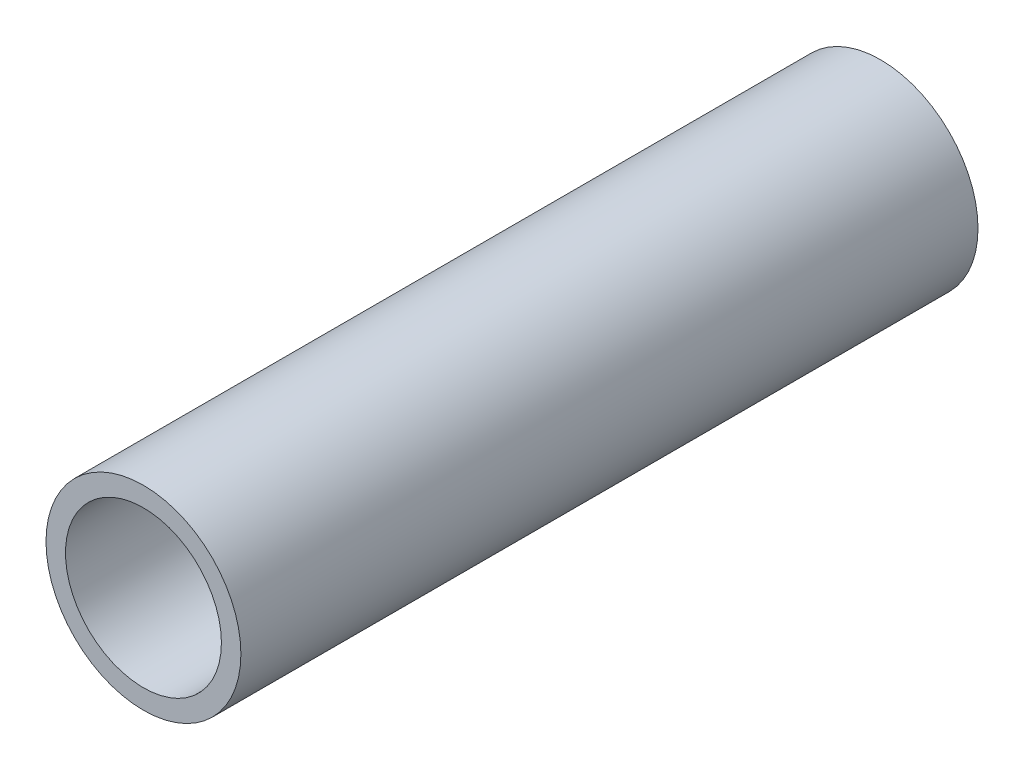
ISO-10303-21;
HEADER;
FILE_DESCRIPTION(('STEP AP214'),'2;1');
FILE_NAME('part.step','',(''),(''),'','','');
FILE_SCHEMA(('AUTOMOTIVE_DESIGN { 1 0 10303 214 1 1 1 1 }'));
ENDSEC;
DATA;
#1=APPLICATION_CONTEXT('core data for automotive mechanical design processes');
#2=APPLICATION_PROTOCOL_DEFINITION('international standard','automotive_design',2000,#1);
#3=PRODUCT_CONTEXT('',#1,'mechanical');
#4=PRODUCT('Part','Part','',(#3));
#5=PRODUCT_RELATED_PRODUCT_CATEGORY('part','',(#4));
#6=PRODUCT_DEFINITION_FORMATION('','',#4);
#7=PRODUCT_DEFINITION_CONTEXT('part definition',#1,'design');
#8=PRODUCT_DEFINITION('design','',#6,#7);
#9=PRODUCT_DEFINITION_SHAPE('','',#8);
#10=(LENGTH_UNIT() NAMED_UNIT(*) SI_UNIT(.MILLI.,.METRE.));
#11=(NAMED_UNIT(*) PLANE_ANGLE_UNIT() SI_UNIT($,.RADIAN.));
#12=(NAMED_UNIT(*) SI_UNIT($,.STERADIAN.) SOLID_ANGLE_UNIT());
#13=UNCERTAINTY_MEASURE_WITH_UNIT(LENGTH_MEASURE(1.E-05),#10,'distance_accuracy_value','');
#14=(GEOMETRIC_REPRESENTATION_CONTEXT(3) GLOBAL_UNCERTAINTY_ASSIGNED_CONTEXT((#13)) GLOBAL_UNIT_ASSIGNED_CONTEXT((#10,
#11,#12)) REPRESENTATION_CONTEXT('',''));
#15=CARTESIAN_POINT('',(0.,0.,0.));
#16=DIRECTION('',(0.,0.,1.));
#17=DIRECTION('',(1.,0.,0.));
#18=AXIS2_PLACEMENT_3D('',#15,#16,#17);
#19=CARTESIAN_POINT('',(0.,0.,9.45499999999958));
#20=DIRECTION('',(0.,0.,1.));
#21=DIRECTION('',(1.,0.,0.));
#22=AXIS2_PLACEMENT_3D('',#19,#20,#21);
#23=PLANE('',#22);
#24=CARTESIAN_POINT('',(0.,0.,9.45499999999958));
#25=DIRECTION('',(0.,0.,1.));
#26=DIRECTION('',(1.,0.,0.));
#27=AXIS2_PLACEMENT_3D('',#24,#25,#26);
#28=CIRCLE('',#27,1.25);
#29=CARTESIAN_POINT('',(1.25,0.,9.45499999999958));
#30=VERTEX_POINT('',#29);
#31=EDGE_CURVE('E10',#30,#30,#28,.T.);
#32=ORIENTED_EDGE('',*,*,#31,.T.);
#33=EDGE_LOOP('',(#32));
#34=FACE_BOUND('',#33,.T.);
#35=CARTESIAN_POINT('',(0.,0.,9.45499999999958));
#36=DIRECTION('',(0.,0.,1.));
#37=DIRECTION('',(1.,0.,0.));
#38=AXIS2_PLACEMENT_3D('',#35,#36,#37);
#39=CIRCLE('',#38,1.);
#40=CARTESIAN_POINT('',(1.,0.,9.45499999999958));
#41=VERTEX_POINT('',#40);
#42=EDGE_CURVE('E41',#41,#41,#39,.T.);
#43=ORIENTED_EDGE('',*,*,#42,.F.);
#44=EDGE_LOOP('',(#43));
#45=FACE_BOUND('',#44,.T.);
#46=ADVANCED_FACE('F30',(#34,#45),#23,.T.);
#47=CARTESIAN_POINT('',(0.,0.,0.));
#48=DIRECTION('',(0.,0.,1.));
#49=DIRECTION('',(1.,0.,0.));
#50=AXIS2_PLACEMENT_3D('',#47,#48,#49);
#51=PLANE('',#50);
#52=CARTESIAN_POINT('',(0.,0.,0.));
#53=DIRECTION('',(0.,0.,1.));
#54=DIRECTION('',(1.,0.,0.));
#55=AXIS2_PLACEMENT_3D('',#52,#53,#54);
#56=CIRCLE('',#55,1.25);
#57=CARTESIAN_POINT('',(1.25,0.,0.));
#58=VERTEX_POINT('',#57);
#59=EDGE_CURVE('E34',#58,#58,#56,.T.);
#60=ORIENTED_EDGE('',*,*,#59,.F.);
#61=EDGE_LOOP('',(#60));
#62=FACE_BOUND('',#61,.T.);
#63=CARTESIAN_POINT('',(0.,0.,0.));
#64=DIRECTION('',(0.,0.,1.));
#65=DIRECTION('',(1.,0.,0.));
#66=AXIS2_PLACEMENT_3D('',#63,#64,#65);
#67=CIRCLE('',#66,1.);
#68=CARTESIAN_POINT('',(1.,0.,0.));
#69=VERTEX_POINT('',#68);
#70=EDGE_CURVE('E43',#69,#69,#67,.T.);
#71=ORIENTED_EDGE('',*,*,#70,.T.);
#72=EDGE_LOOP('',(#71));
#73=FACE_BOUND('',#72,.T.);
#74=ADVANCED_FACE('F53',(#62,#73),#51,.F.);
#75=CARTESIAN_POINT('',(0.,0.,9.45499999999958));
#76=DIRECTION('',(0.,0.,-1.));
#77=DIRECTION('',(-1.,0.,0.));
#78=AXIS2_PLACEMENT_3D('',#75,#76,#77);
#79=CYLINDRICAL_SURFACE('',#78,1.25);
#80=ORIENTED_EDGE('',*,*,#31,.F.);
#81=EDGE_LOOP('',(#80));
#82=FACE_BOUND('',#81,.T.);
#83=ORIENTED_EDGE('',*,*,#59,.T.);
#84=EDGE_LOOP('',(#83));
#85=FACE_BOUND('',#84,.T.);
#86=ADVANCED_FACE('F32',(#82,#85),#79,.T.);
#87=CARTESIAN_POINT('',(0.,0.,9.45499999999958));
#88=DIRECTION('',(0.,0.,-1.));
#89=DIRECTION('',(-1.,0.,0.));
#90=AXIS2_PLACEMENT_3D('',#87,#88,#89);
#91=CYLINDRICAL_SURFACE('',#90,1.);
#92=ORIENTED_EDGE('',*,*,#42,.T.);
#93=EDGE_LOOP('',(#92));
#94=FACE_BOUND('',#93,.T.);
#95=ORIENTED_EDGE('',*,*,#70,.F.);
#96=EDGE_LOOP('',(#95));
#97=FACE_BOUND('',#96,.T.);
#98=ADVANCED_FACE('F49',(#94,#97),#91,.F.);
#99=CLOSED_SHELL('',(#46,#74,#86,#98));
#100=MANIFOLD_SOLID_BREP('B2',#99);
#101=ADVANCED_BREP_SHAPE_REPRESENTATION('',(#18,#100),#14);
#102=SHAPE_DEFINITION_REPRESENTATION(#9,#101);
ENDSEC;
END-ISO-10303-21;
